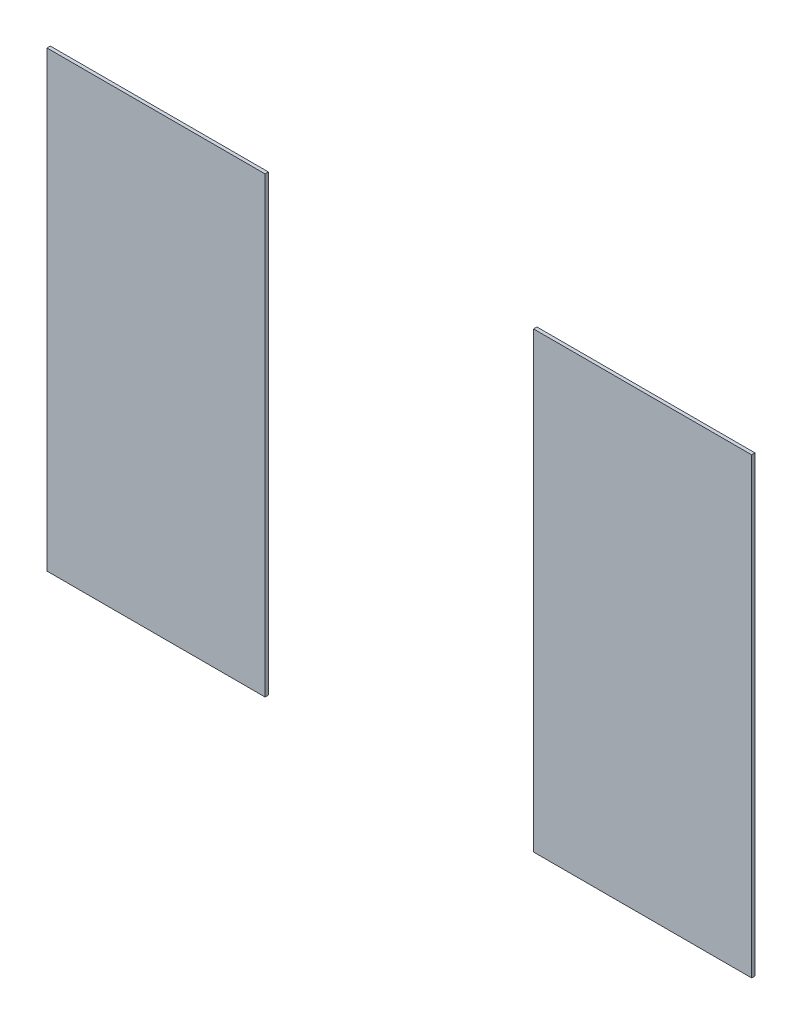
ISO-10303-21;
HEADER;
FILE_DESCRIPTION(('STEP AP214'),'2;1');
FILE_NAME('part.step','',(''),(''),'','','');
FILE_SCHEMA(('AUTOMOTIVE_DESIGN { 1 0 10303 214 1 1 1 1 }'));
ENDSEC;
DATA;
#1=APPLICATION_CONTEXT('core data for automotive mechanical design processes');
#2=APPLICATION_PROTOCOL_DEFINITION('international standard','automotive_design',2000,#1);
#3=PRODUCT_CONTEXT('',#1,'mechanical');
#4=PRODUCT('Part','Part','',(#3));
#5=PRODUCT_RELATED_PRODUCT_CATEGORY('part','',(#4));
#6=PRODUCT_DEFINITION_FORMATION('','',#4);
#7=PRODUCT_DEFINITION_CONTEXT('part definition',#1,'design');
#8=PRODUCT_DEFINITION('design','',#6,#7);
#9=PRODUCT_DEFINITION_SHAPE('','',#8);
#10=(LENGTH_UNIT() NAMED_UNIT(*) SI_UNIT(.MILLI.,.METRE.));
#11=(NAMED_UNIT(*) PLANE_ANGLE_UNIT() SI_UNIT($,.RADIAN.));
#12=(NAMED_UNIT(*) SI_UNIT($,.STERADIAN.) SOLID_ANGLE_UNIT());
#13=UNCERTAINTY_MEASURE_WITH_UNIT(LENGTH_MEASURE(1.E-05),#10,'distance_accuracy_value','');
#14=(GEOMETRIC_REPRESENTATION_CONTEXT(3) GLOBAL_UNCERTAINTY_ASSIGNED_CONTEXT((#13)) GLOBAL_UNIT_ASSIGNED_CONTEXT((#10,
#11,#12)) REPRESENTATION_CONTEXT('',''));
#15=CARTESIAN_POINT('',(0.,0.,0.));
#16=DIRECTION('',(0.,0.,1.));
#17=DIRECTION('',(1.,0.,0.));
#18=AXIS2_PLACEMENT_3D('',#15,#16,#17);
#19=CARTESIAN_POINT('',(2.1,1.35,0.02));
#20=DIRECTION('',(-1.,0.,0.));
#21=DIRECTION('',(0.,0.,1.));
#22=AXIS2_PLACEMENT_3D('',#19,#20,#21);
#23=PLANE('',#22);
#24=DIRECTION('',(0.,1.,0.));
#25=VECTOR('',#24,1.);
#26=CARTESIAN_POINT('',(2.1,1.35,0.));
#27=LINE('',#26,#25);
#28=CARTESIAN_POINT('',(2.1,-1.35,0.));
#29=VERTEX_POINT('',#28);
#30=CARTESIAN_POINT('',(2.1,1.35,0.));
#31=VERTEX_POINT('',#30);
#32=EDGE_CURVE('E103',#29,#31,#27,.T.);
#33=ORIENTED_EDGE('',*,*,#32,.T.);
#34=DIRECTION('',(0.,0.,-1.));
#35=VECTOR('',#34,1.);
#36=CARTESIAN_POINT('',(2.1,1.35,0.02));
#37=LINE('',#36,#35);
#38=CARTESIAN_POINT('',(2.1,1.35,0.02));
#39=VERTEX_POINT('',#38);
#40=EDGE_CURVE('E12',#39,#31,#37,.T.);
#41=ORIENTED_EDGE('',*,*,#40,.F.);
#42=DIRECTION('',(0.,1.,0.));
#43=VECTOR('',#42,1.);
#44=CARTESIAN_POINT('',(2.1,1.35,0.02));
#45=LINE('',#44,#43);
#46=CARTESIAN_POINT('',(2.1,-1.35,0.02));
#47=VERTEX_POINT('',#46);
#48=EDGE_CURVE('E91',#47,#39,#45,.T.);
#49=ORIENTED_EDGE('',*,*,#48,.F.);
#50=DIRECTION('',(0.,0.,-1.));
#51=VECTOR('',#50,1.);
#52=CARTESIAN_POINT('',(2.1,-1.35,0.02));
#53=LINE('',#52,#51);
#54=EDGE_CURVE('E99',#47,#29,#53,.T.);
#55=ORIENTED_EDGE('',*,*,#54,.T.);
#56=EDGE_LOOP('',(#33,#41,#49,#55));
#57=FACE_BOUND('',#56,.T.);
#58=ADVANCED_FACE('F40',(#57),#23,.F.);
#59=CARTESIAN_POINT('',(0.8,1.35,0.02));
#60=DIRECTION('',(0.,-1.,0.));
#61=DIRECTION('',(0.,0.,-1.));
#62=AXIS2_PLACEMENT_3D('',#59,#60,#61);
#63=PLANE('',#62);
#64=DIRECTION('',(-1.,0.,0.));
#65=VECTOR('',#64,1.);
#66=CARTESIAN_POINT('',(0.8,1.35,0.));
#67=LINE('',#66,#65);
#68=CARTESIAN_POINT('',(0.8,1.35,0.));
#69=VERTEX_POINT('',#68);
#70=EDGE_CURVE('E95',#31,#69,#67,.T.);
#71=ORIENTED_EDGE('',*,*,#70,.T.);
#72=DIRECTION('',(0.,0.,-1.));
#73=VECTOR('',#72,1.);
#74=CARTESIAN_POINT('',(0.8,1.35,0.02));
#75=LINE('',#74,#73);
#76=CARTESIAN_POINT('',(0.8,1.35,0.02));
#77=VERTEX_POINT('',#76);
#78=EDGE_CURVE('E48',#77,#69,#75,.T.);
#79=ORIENTED_EDGE('',*,*,#78,.F.);
#80=DIRECTION('',(-1.,0.,0.));
#81=VECTOR('',#80,1.);
#82=CARTESIAN_POINT('',(0.8,1.35,0.02));
#83=LINE('',#82,#81);
#84=EDGE_CURVE('E86',#39,#77,#83,.T.);
#85=ORIENTED_EDGE('',*,*,#84,.F.);
#86=ORIENTED_EDGE('',*,*,#40,.T.);
#87=EDGE_LOOP('',(#71,#79,#85,#86));
#88=FACE_BOUND('',#87,.T.);
#89=ADVANCED_FACE('F94',(#88),#63,.F.);
#90=CARTESIAN_POINT('',(0.8,1.35,0.02));
#91=DIRECTION('',(1.,0.,0.));
#92=DIRECTION('',(0.,1.,0.));
#93=AXIS2_PLACEMENT_3D('',#90,#91,#92);
#94=PLANE('',#93);
#95=DIRECTION('',(0.,-1.,0.));
#96=VECTOR('',#95,1.);
#97=CARTESIAN_POINT('',(0.8,1.35,0.));
#98=LINE('',#97,#96);
#99=CARTESIAN_POINT('',(0.8,-1.35,0.));
#100=VERTEX_POINT('',#99);
#101=EDGE_CURVE('E73',#69,#100,#98,.T.);
#102=ORIENTED_EDGE('',*,*,#101,.T.);
#103=DIRECTION('',(0.,0.,-1.));
#104=VECTOR('',#103,1.);
#105=CARTESIAN_POINT('',(0.8,-1.35,0.02));
#106=LINE('',#105,#104);
#107=CARTESIAN_POINT('',(0.8,-1.35,0.02));
#108=VERTEX_POINT('',#107);
#109=EDGE_CURVE('E96',#108,#100,#106,.T.);
#110=ORIENTED_EDGE('',*,*,#109,.F.);
#111=DIRECTION('',(0.,-1.,0.));
#112=VECTOR('',#111,1.);
#113=CARTESIAN_POINT('',(0.8,1.35,0.02));
#114=LINE('',#113,#112);
#115=EDGE_CURVE('E89',#77,#108,#114,.T.);
#116=ORIENTED_EDGE('',*,*,#115,.F.);
#117=ORIENTED_EDGE('',*,*,#78,.T.);
#118=EDGE_LOOP('',(#102,#110,#116,#117));
#119=FACE_BOUND('',#118,.T.);
#120=ADVANCED_FACE('F97',(#119),#94,.F.);
#121=CARTESIAN_POINT('',(0.8,-1.35,0.02));
#122=DIRECTION('',(0.,1.,0.));
#123=DIRECTION('',(0.,0.,1.));
#124=AXIS2_PLACEMENT_3D('',#121,#122,#123);
#125=PLANE('',#124);
#126=DIRECTION('',(1.,0.,0.));
#127=VECTOR('',#126,1.);
#128=CARTESIAN_POINT('',(0.8,-1.35,0.));
#129=LINE('',#128,#127);
#130=EDGE_CURVE('E79',#100,#29,#129,.T.);
#131=ORIENTED_EDGE('',*,*,#130,.T.);
#132=ORIENTED_EDGE('',*,*,#54,.F.);
#133=DIRECTION('',(1.,0.,0.));
#134=VECTOR('',#133,1.);
#135=CARTESIAN_POINT('',(0.8,-1.35,0.02));
#136=LINE('',#135,#134);
#137=EDGE_CURVE('E56',#108,#47,#136,.T.);
#138=ORIENTED_EDGE('',*,*,#137,.F.);
#139=ORIENTED_EDGE('',*,*,#109,.T.);
#140=EDGE_LOOP('',(#131,#132,#138,#139));
#141=FACE_BOUND('',#140,.T.);
#142=ADVANCED_FACE('F110',(#141),#125,.F.);
#143=CARTESIAN_POINT('',(2.1,-1.35,0.02));
#144=DIRECTION('',(0.,0.,1.));
#145=DIRECTION('',(1.,0.,0.));
#146=AXIS2_PLACEMENT_3D('',#143,#144,#145);
#147=PLANE('',#146);
#148=ORIENTED_EDGE('',*,*,#48,.T.);
#149=ORIENTED_EDGE('',*,*,#84,.T.);
#150=ORIENTED_EDGE('',*,*,#115,.T.);
#151=ORIENTED_EDGE('',*,*,#137,.T.);
#152=EDGE_LOOP('',(#148,#149,#150,#151));
#153=FACE_BOUND('',#152,.T.);
#154=ADVANCED_FACE('F87',(#153),#147,.T.);
#155=CARTESIAN_POINT('',(2.1,-1.35,0.));
#156=DIRECTION('',(0.,0.,1.));
#157=DIRECTION('',(1.,0.,0.));
#158=AXIS2_PLACEMENT_3D('',#155,#156,#157);
#159=PLANE('',#158);
#160=ORIENTED_EDGE('',*,*,#32,.F.);
#161=ORIENTED_EDGE('',*,*,#130,.F.);
#162=ORIENTED_EDGE('',*,*,#101,.F.);
#163=ORIENTED_EDGE('',*,*,#70,.F.);
#164=EDGE_LOOP('',(#160,#161,#162,#163));
#165=FACE_BOUND('',#164,.T.);
#166=ADVANCED_FACE('F113',(#165),#159,.F.);
#167=CLOSED_SHELL('',(#58,#89,#120,#142,#154,#166));
#168=MANIFOLD_SOLID_BREP('B2',#167);
#169=CARTESIAN_POINT('',(-0.8,1.35,0.02));
#170=DIRECTION('',(-1.,0.,0.));
#171=DIRECTION('',(0.,-1.,0.));
#172=AXIS2_PLACEMENT_3D('',#169,#170,#171);
#173=PLANE('',#172);
#174=DIRECTION('',(0.,1.,0.));
#175=VECTOR('',#174,1.);
#176=CARTESIAN_POINT('',(-0.8,1.35,0.));
#177=LINE('',#176,#175);
#178=CARTESIAN_POINT('',(-0.8,-1.35,0.));
#179=VERTEX_POINT('',#178);
#180=CARTESIAN_POINT('',(-0.8,1.35,0.));
#181=VERTEX_POINT('',#180);
#182=EDGE_CURVE('E226',#179,#181,#177,.T.);
#183=ORIENTED_EDGE('',*,*,#182,.T.);
#184=DIRECTION('',(0.,0.,-1.));
#185=VECTOR('',#184,1.);
#186=CARTESIAN_POINT('',(-0.8,1.35,0.02));
#187=LINE('',#186,#185);
#188=CARTESIAN_POINT('',(-0.8,1.35,0.02));
#189=VERTEX_POINT('',#188);
#190=EDGE_CURVE('E38',#189,#181,#187,.T.);
#191=ORIENTED_EDGE('',*,*,#190,.F.);
#192=DIRECTION('',(0.,1.,0.));
#193=VECTOR('',#192,1.);
#194=CARTESIAN_POINT('',(-0.8,1.35,0.02));
#195=LINE('',#194,#193);
#196=CARTESIAN_POINT('',(-0.8,-1.35,0.02));
#197=VERTEX_POINT('',#196);
#198=EDGE_CURVE('E214',#197,#189,#195,.T.);
#199=ORIENTED_EDGE('',*,*,#198,.F.);
#200=DIRECTION('',(0.,0.,-1.));
#201=VECTOR('',#200,1.);
#202=CARTESIAN_POINT('',(-0.8,-1.35,0.02));
#203=LINE('',#202,#201);
#204=EDGE_CURVE('E222',#197,#179,#203,.T.);
#205=ORIENTED_EDGE('',*,*,#204,.T.);
#206=EDGE_LOOP('',(#183,#191,#199,#205));
#207=FACE_BOUND('',#206,.T.);
#208=ADVANCED_FACE('F163',(#207),#173,.F.);
#209=CARTESIAN_POINT('',(-2.1,1.35,0.02));
#210=DIRECTION('',(0.,-1.,0.));
#211=DIRECTION('',(0.,0.,-1.));
#212=AXIS2_PLACEMENT_3D('',#209,#210,#211);
#213=PLANE('',#212);
#214=DIRECTION('',(-1.,0.,0.));
#215=VECTOR('',#214,1.);
#216=CARTESIAN_POINT('',(-2.1,1.35,0.));
#217=LINE('',#216,#215);
#218=CARTESIAN_POINT('',(-2.1,1.35,0.));
#219=VERTEX_POINT('',#218);
#220=EDGE_CURVE('E218',#181,#219,#217,.T.);
#221=ORIENTED_EDGE('',*,*,#220,.T.);
#222=DIRECTION('',(0.,0.,-1.));
#223=VECTOR('',#222,1.);
#224=CARTESIAN_POINT('',(-2.1,1.35,0.02));
#225=LINE('',#224,#223);
#226=CARTESIAN_POINT('',(-2.1,1.35,0.02));
#227=VERTEX_POINT('',#226);
#228=EDGE_CURVE('E171',#227,#219,#225,.T.);
#229=ORIENTED_EDGE('',*,*,#228,.F.);
#230=DIRECTION('',(-1.,0.,0.));
#231=VECTOR('',#230,1.);
#232=CARTESIAN_POINT('',(-2.1,1.35,0.02));
#233=LINE('',#232,#231);
#234=EDGE_CURVE('E209',#189,#227,#233,.T.);
#235=ORIENTED_EDGE('',*,*,#234,.F.);
#236=ORIENTED_EDGE('',*,*,#190,.T.);
#237=EDGE_LOOP('',(#221,#229,#235,#236));
#238=FACE_BOUND('',#237,.T.);
#239=ADVANCED_FACE('F217',(#238),#213,.F.);
#240=CARTESIAN_POINT('',(-2.1,1.35,0.02));
#241=DIRECTION('',(1.,0.,0.));
#242=DIRECTION('',(0.,0.,-1.));
#243=AXIS2_PLACEMENT_3D('',#240,#241,#242);
#244=PLANE('',#243);
#245=DIRECTION('',(0.,-1.,0.));
#246=VECTOR('',#245,1.);
#247=CARTESIAN_POINT('',(-2.1,1.35,0.));
#248=LINE('',#247,#246);
#249=CARTESIAN_POINT('',(-2.1,-1.35,0.));
#250=VERTEX_POINT('',#249);
#251=EDGE_CURVE('E196',#219,#250,#248,.T.);
#252=ORIENTED_EDGE('',*,*,#251,.T.);
#253=DIRECTION('',(0.,0.,-1.));
#254=VECTOR('',#253,1.);
#255=CARTESIAN_POINT('',(-2.1,-1.35,0.02));
#256=LINE('',#255,#254);
#257=CARTESIAN_POINT('',(-2.1,-1.35,0.02));
#258=VERTEX_POINT('',#257);
#259=EDGE_CURVE('E219',#258,#250,#256,.T.);
#260=ORIENTED_EDGE('',*,*,#259,.F.);
#261=DIRECTION('',(0.,-1.,0.));
#262=VECTOR('',#261,1.);
#263=CARTESIAN_POINT('',(-2.1,1.35,0.02));
#264=LINE('',#263,#262);
#265=EDGE_CURVE('E212',#227,#258,#264,.T.);
#266=ORIENTED_EDGE('',*,*,#265,.F.);
#267=ORIENTED_EDGE('',*,*,#228,.T.);
#268=EDGE_LOOP('',(#252,#260,#266,#267));
#269=FACE_BOUND('',#268,.T.);
#270=ADVANCED_FACE('F220',(#269),#244,.F.);
#271=CARTESIAN_POINT('',(-2.1,-1.35,0.02));
#272=DIRECTION('',(0.,1.,0.));
#273=DIRECTION('',(-1.,0.,0.));
#274=AXIS2_PLACEMENT_3D('',#271,#272,#273);
#275=PLANE('',#274);
#276=DIRECTION('',(1.,0.,0.));
#277=VECTOR('',#276,1.);
#278=CARTESIAN_POINT('',(-2.1,-1.35,0.));
#279=LINE('',#278,#277);
#280=EDGE_CURVE('E202',#250,#179,#279,.T.);
#281=ORIENTED_EDGE('',*,*,#280,.T.);
#282=ORIENTED_EDGE('',*,*,#204,.F.);
#283=DIRECTION('',(1.,0.,0.));
#284=VECTOR('',#283,1.);
#285=CARTESIAN_POINT('',(-2.1,-1.35,0.02));
#286=LINE('',#285,#284);
#287=EDGE_CURVE('E179',#258,#197,#286,.T.);
#288=ORIENTED_EDGE('',*,*,#287,.F.);
#289=ORIENTED_EDGE('',*,*,#259,.T.);
#290=EDGE_LOOP('',(#281,#282,#288,#289));
#291=FACE_BOUND('',#290,.T.);
#292=ADVANCED_FACE('F233',(#291),#275,.F.);
#293=CARTESIAN_POINT('',(-0.8,-1.35,0.02));
#294=DIRECTION('',(0.,0.,1.));
#295=DIRECTION('',(1.,0.,0.));
#296=AXIS2_PLACEMENT_3D('',#293,#294,#295);
#297=PLANE('',#296);
#298=ORIENTED_EDGE('',*,*,#198,.T.);
#299=ORIENTED_EDGE('',*,*,#234,.T.);
#300=ORIENTED_EDGE('',*,*,#265,.T.);
#301=ORIENTED_EDGE('',*,*,#287,.T.);
#302=EDGE_LOOP('',(#298,#299,#300,#301));
#303=FACE_BOUND('',#302,.T.);
#304=ADVANCED_FACE('F210',(#303),#297,.T.);
#305=CARTESIAN_POINT('',(-0.8,-1.35,0.));
#306=DIRECTION('',(0.,0.,1.));
#307=DIRECTION('',(1.,0.,0.));
#308=AXIS2_PLACEMENT_3D('',#305,#306,#307);
#309=PLANE('',#308);
#310=ORIENTED_EDGE('',*,*,#182,.F.);
#311=ORIENTED_EDGE('',*,*,#280,.F.);
#312=ORIENTED_EDGE('',*,*,#251,.F.);
#313=ORIENTED_EDGE('',*,*,#220,.F.);
#314=EDGE_LOOP('',(#310,#311,#312,#313));
#315=FACE_BOUND('',#314,.T.);
#316=ADVANCED_FACE('F236',(#315),#309,.F.);
#317=CLOSED_SHELL('',(#208,#239,#270,#292,#304,#316));
#318=MANIFOLD_SOLID_BREP('B6',#317);
#319=ADVANCED_BREP_SHAPE_REPRESENTATION('',(#18,#168,#318),#14);
#320=SHAPE_DEFINITION_REPRESENTATION(#9,#319);
ENDSEC;
END-ISO-10303-21;
